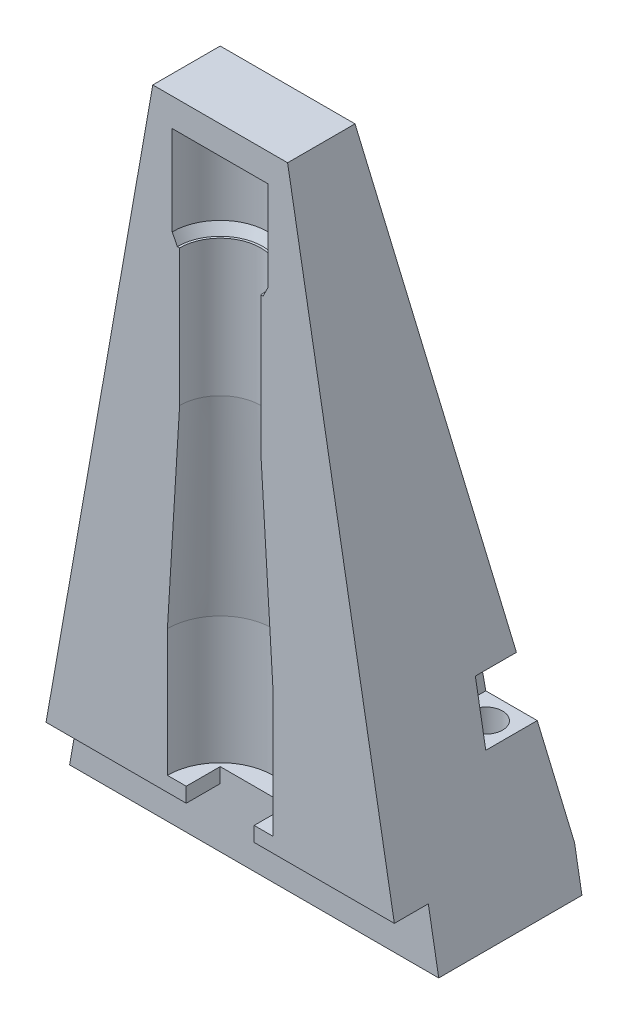
ISO-10303-21;
HEADER;
FILE_DESCRIPTION(('STEP AP214'),'2;1');
FILE_NAME('part.step','',(''),(''),'','','');
FILE_SCHEMA(('AUTOMOTIVE_DESIGN { 1 0 10303 214 1 1 1 1 }'));
ENDSEC;
DATA;
#1=APPLICATION_CONTEXT('core data for automotive mechanical design processes');
#2=APPLICATION_PROTOCOL_DEFINITION('international standard','automotive_design',2000,#1);
#3=PRODUCT_CONTEXT('',#1,'mechanical');
#4=PRODUCT('Part','Part','',(#3));
#5=PRODUCT_RELATED_PRODUCT_CATEGORY('part','',(#4));
#6=PRODUCT_DEFINITION_FORMATION('','',#4);
#7=PRODUCT_DEFINITION_CONTEXT('part definition',#1,'design');
#8=PRODUCT_DEFINITION('design','',#6,#7);
#9=PRODUCT_DEFINITION_SHAPE('','',#8);
#10=(LENGTH_UNIT() NAMED_UNIT(*) SI_UNIT(.MILLI.,.METRE.));
#11=(NAMED_UNIT(*) PLANE_ANGLE_UNIT() SI_UNIT($,.RADIAN.));
#12=(NAMED_UNIT(*) SI_UNIT($,.STERADIAN.) SOLID_ANGLE_UNIT());
#13=UNCERTAINTY_MEASURE_WITH_UNIT(LENGTH_MEASURE(1.E-05),#10,'distance_accuracy_value','');
#14=(GEOMETRIC_REPRESENTATION_CONTEXT(3) GLOBAL_UNCERTAINTY_ASSIGNED_CONTEXT((#13)) GLOBAL_UNIT_ASSIGNED_CONTEXT((#10,
#11,#12)) REPRESENTATION_CONTEXT('',''));
#15=CARTESIAN_POINT('',(0.,0.,0.));
#16=DIRECTION('',(0.,0.,1.));
#17=DIRECTION('',(1.,0.,0.));
#18=AXIS2_PLACEMENT_3D('',#15,#16,#17);
#19=CARTESIAN_POINT('',(-25.,0.,-25.));
#20=DIRECTION('',(0.,0.17364817766693,-0.984807753012208));
#21=DIRECTION('',(0.,0.984807753012208,0.17364817766693));
#22=AXIS2_PLACEMENT_3D('',#19,#20,#21);
#23=PLANE('',#22);
#24=DIRECTION('',(0.171087869746036,-0.970287525247814,-0.171087869746036));
#25=VECTOR('',#24,1.);
#26=CARTESIAN_POINT('',(23.5364470412882,8.30022128679006,-23.5364470412882));
#27=LINE('',#26,#25);
#28=CARTESIAN_POINT('',(21.4734603858307,20.,-21.4734603858307));
#29=VERTEX_POINT('',#28);
#30=CARTESIAN_POINT('',(24.,5.6712818196179,-24.));
#31=VERTEX_POINT('',#30);
#32=EDGE_CURVE('E242',#29,#31,#27,.T.);
#33=ORIENTED_EDGE('',*,*,#32,.T.);
#34=DIRECTION('',(1.,0.,0.));
#35=VECTOR('',#34,1.);
#36=CARTESIAN_POINT('',(-25.,5.67128181961774,-24.));
#37=LINE('',#36,#35);
#38=CARTESIAN_POINT('',(-24.,5.67128181961774,-24.));
#39=VERTEX_POINT('',#38);
#40=EDGE_CURVE('E224',#31,#39,#37,.F.);
#41=ORIENTED_EDGE('',*,*,#40,.T.);
#42=DIRECTION('',(-0.171087869746036,-0.970287525247814,-0.171087869746036));
#43=VECTOR('',#42,1.);
#44=CARTESIAN_POINT('',(-25.,0.,-25.));
#45=LINE('',#44,#43);
#46=CARTESIAN_POINT('',(-21.4734603858307,20.,-21.4734603858307));
#47=VERTEX_POINT('',#46);
#48=EDGE_CURVE('E223',#47,#39,#45,.T.);
#49=ORIENTED_EDGE('',*,*,#48,.F.);
#50=DIRECTION('',(1.,0.,0.));
#51=VECTOR('',#50,1.);
#52=CARTESIAN_POINT('',(-25.,20.,-21.4734603858307));
#53=LINE('',#52,#51);
#54=CARTESIAN_POINT('',(-14.5,20.,-21.4734603858307));
#55=VERTEX_POINT('',#54);
#56=EDGE_CURVE('E354',#55,#47,#53,.F.);
#57=ORIENTED_EDGE('',*,*,#56,.F.);
#58=DIRECTION('',(0.,0.984807753012208,0.17364817766693));
#59=VECTOR('',#58,1.);
#60=CARTESIAN_POINT('',(-14.5,0.,-25.));
#61=LINE('',#60,#59);
#62=CARTESIAN_POINT('',(-14.5,28.,-20.062844540163));
#63=VERTEX_POINT('',#62);
#64=EDGE_CURVE('E293',#63,#55,#61,.F.);
#65=ORIENTED_EDGE('',*,*,#64,.F.);
#66=DIRECTION('',(-1.,0.,0.));
#67=VECTOR('',#66,1.);
#68=CARTESIAN_POINT('',(-25.,28.,-20.062844540163));
#69=LINE('',#68,#67);
#70=CARTESIAN_POINT('',(-20.062844540163,28.,-20.062844540163));
#71=VERTEX_POINT('',#70);
#72=EDGE_CURVE('E352',#71,#63,#69,.F.);
#73=ORIENTED_EDGE('',*,*,#72,.F.);
#74=CARTESIAN_POINT('',(-9.13057173623815,90.,-9.13057173623815));
#75=VERTEX_POINT('',#74);
#76=EDGE_CURVE('E243',#75,#71,#45,.T.);
#77=ORIENTED_EDGE('',*,*,#76,.F.);
#78=DIRECTION('',(1.,0.,0.));
#79=VECTOR('',#78,1.);
#80=CARTESIAN_POINT('',(-25.,90.,-9.13057173623815));
#81=LINE('',#80,#79);
#82=CARTESIAN_POINT('',(9.13057173623814,90.,-9.13057173623815));
#83=VERTEX_POINT('',#82);
#84=EDGE_CURVE('E232',#83,#75,#81,.F.);
#85=ORIENTED_EDGE('',*,*,#84,.F.);
#86=CARTESIAN_POINT('',(20.062844540163,28.,-20.062844540163));
#87=VERTEX_POINT('',#86);
#88=EDGE_CURVE('E238',#83,#87,#27,.T.);
#89=ORIENTED_EDGE('',*,*,#88,.T.);
#90=DIRECTION('',(1.,0.,0.));
#91=VECTOR('',#90,1.);
#92=CARTESIAN_POINT('',(-25.,28.,-20.062844540163));
#93=LINE('',#92,#91);
#94=CARTESIAN_POINT('',(14.5,28.,-20.062844540163));
#95=VERTEX_POINT('',#94);
#96=EDGE_CURVE('E309',#87,#95,#93,.F.);
#97=ORIENTED_EDGE('',*,*,#96,.T.);
#98=DIRECTION('',(0.,0.984807753012208,0.17364817766693));
#99=VECTOR('',#98,1.);
#100=CARTESIAN_POINT('',(14.5,0.,-25.));
#101=LINE('',#100,#99);
#102=CARTESIAN_POINT('',(14.5,20.,-21.4734603858307));
#103=VERTEX_POINT('',#102);
#104=EDGE_CURVE('E45',#95,#103,#101,.F.);
#105=ORIENTED_EDGE('',*,*,#104,.T.);
#106=DIRECTION('',(-1.,0.,0.));
#107=VECTOR('',#106,1.);
#108=CARTESIAN_POINT('',(-25.,20.,-21.4734603858307));
#109=LINE('',#108,#107);
#110=EDGE_CURVE('E307',#103,#29,#109,.F.);
#111=ORIENTED_EDGE('',*,*,#110,.T.);
#112=EDGE_LOOP('',(#33,#41,#49,#57,#65,#73,#77,#85,#89,#97,#105,#111));
#113=FACE_BOUND('',#112,.T.);
#114=ADVANCED_FACE('F37',(#113),#23,.T.);
#115=CARTESIAN_POINT('',(-25.,0.,-25.));
#116=DIRECTION('',(-0.984807753012208,0.17364817766693,0.));
#117=DIRECTION('',(-0.17364817766693,-0.984807753012208,0.));
#118=AXIS2_PLACEMENT_3D('',#115,#116,#117);
#119=PLANE('',#118);
#120=ORIENTED_EDGE('',*,*,#48,.T.);
#121=DIRECTION('',(0.17364817766693,0.984807753012208,0.));
#122=VECTOR('',#121,1.);
#123=CARTESIAN_POINT('',(-25.,0.,-24.));
#124=LINE('',#123,#122);
#125=CARTESIAN_POINT('',(-25.,0.,-24.));
#126=VERTEX_POINT('',#125);
#127=EDGE_CURVE('E209',#39,#126,#124,.F.);
#128=ORIENTED_EDGE('',*,*,#127,.T.);
#129=DIRECTION('',(0.,0.,1.));
#130=VECTOR('',#129,1.);
#131=CARTESIAN_POINT('',(-25.,0.,-25.));
#132=LINE('',#131,#130);
#133=CARTESIAN_POINT('',(-25.,0.,-4.60000000000001));
#134=VERTEX_POINT('',#133);
#135=EDGE_CURVE('E219',#126,#134,#132,.T.);
#136=ORIENTED_EDGE('',*,*,#135,.T.);
#137=DIRECTION('',(-0.17364817766693,-0.984807753012208,0.));
#138=VECTOR('',#137,1.);
#139=CARTESIAN_POINT('',(-25.,0.,-4.60000000000001));
#140=LINE('',#139,#138);
#141=CARTESIAN_POINT('',(-23.5893841543323,8.,-4.60000000000001));
#142=VERTEX_POINT('',#141);
#143=EDGE_CURVE('E381',#134,#142,#140,.F.);
#144=ORIENTED_EDGE('',*,*,#143,.T.);
#145=DIRECTION('',(0.,0.,-1.));
#146=VECTOR('',#145,1.);
#147=CARTESIAN_POINT('',(-23.5893841543323,8.,-25.));
#148=LINE('',#147,#146);
#149=CARTESIAN_POINT('',(-23.5893841543323,8.,0.));
#150=VERTEX_POINT('',#149);
#151=EDGE_CURVE('E375',#142,#150,#148,.F.);
#152=ORIENTED_EDGE('',*,*,#151,.T.);
#153=DIRECTION('',(-0.17364817766693,-0.984807753012208,0.));
#154=VECTOR('',#153,1.);
#155=CARTESIAN_POINT('',(-25.,0.,0.));
#156=LINE('',#155,#154);
#157=CARTESIAN_POINT('',(-9.13057173623815,90.,0.));
#158=VERTEX_POINT('',#157);
#159=EDGE_CURVE('E411',#150,#158,#156,.F.);
#160=ORIENTED_EDGE('',*,*,#159,.T.);
#161=DIRECTION('',(0.,0.,-1.));
#162=VECTOR('',#161,1.);
#163=CARTESIAN_POINT('',(-9.13057173623816,90.,-25.));
#164=LINE('',#163,#162);
#165=EDGE_CURVE('E247',#75,#158,#164,.F.);
#166=ORIENTED_EDGE('',*,*,#165,.F.);
#167=ORIENTED_EDGE('',*,*,#76,.T.);
#168=DIRECTION('',(0.,0.,1.));
#169=VECTOR('',#168,1.);
#170=CARTESIAN_POINT('',(-20.062844540163,28.,-25.));
#171=LINE('',#170,#169);
#172=CARTESIAN_POINT('',(-20.062844540163,28.,-14.5));
#173=VERTEX_POINT('',#172);
#174=EDGE_CURVE('E288',#173,#71,#171,.F.);
#175=ORIENTED_EDGE('',*,*,#174,.F.);
#176=DIRECTION('',(-0.17364817766693,-0.984807753012208,0.));
#177=VECTOR('',#176,1.);
#178=CARTESIAN_POINT('',(-25.,0.,-14.5));
#179=LINE('',#178,#177);
#180=CARTESIAN_POINT('',(-21.4734603858307,20.,-14.5));
#181=VERTEX_POINT('',#180);
#182=EDGE_CURVE('E286',#181,#173,#179,.F.);
#183=ORIENTED_EDGE('',*,*,#182,.F.);
#184=DIRECTION('',(0.,0.,-1.));
#185=VECTOR('',#184,1.);
#186=CARTESIAN_POINT('',(-21.4734603858307,20.,-25.));
#187=LINE('',#186,#185);
#188=EDGE_CURVE('E290',#47,#181,#187,.F.);
#189=ORIENTED_EDGE('',*,*,#188,.F.);
#190=EDGE_LOOP('',(#120,#128,#136,#144,#152,#160,#166,#167,#175,#183,#189));
#191=FACE_BOUND('',#190,.T.);
#192=ADVANCED_FACE('F217',(#191),#119,.T.);
#193=CARTESIAN_POINT('',(0.,0.,0.));
#194=DIRECTION('',(0.,0.,-1.));
#195=DIRECTION('',(-1.,0.,0.));
#196=AXIS2_PLACEMENT_3D('',#193,#194,#195);
#197=PLANE('',#196);
#198=ORIENTED_EDGE('',*,*,#159,.F.);
#199=DIRECTION('',(-1.,0.,0.));
#200=VECTOR('',#199,1.);
#201=CARTESIAN_POINT('',(25.,8.,0.));
#202=LINE('',#201,#200);
#203=CARTESIAN_POINT('',(-4.6,8.,0.));
#204=VERTEX_POINT('',#203);
#205=EDGE_CURVE('E368',#204,#150,#202,.T.);
#206=ORIENTED_EDGE('',*,*,#205,.F.);
#207=DIRECTION('',(0.,1.,0.));
#208=VECTOR('',#207,1.);
#209=CARTESIAN_POINT('',(-4.6,30.2638391437749,0.));
#210=LINE('',#209,#208);
#211=CARTESIAN_POINT('',(-4.6,10.,0.));
#212=VERTEX_POINT('',#211);
#213=EDGE_CURVE('E388',#212,#204,#210,.F.);
#214=ORIENTED_EDGE('',*,*,#213,.F.);
#215=DIRECTION('',(-1.,0.,0.));
#216=VECTOR('',#215,1.);
#217=CARTESIAN_POINT('',(0.,10.,0.));
#218=LINE('',#217,#216);
#219=CARTESIAN_POINT('',(-7.15,9.99999999999999,0.));
#220=VERTEX_POINT('',#219);
#221=EDGE_CURVE('E241',#212,#220,#218,.T.);
#222=ORIENTED_EDGE('',*,*,#221,.T.);
#223=DIRECTION('',(0.,1.,0.));
#224=VECTOR('',#223,1.);
#225=CARTESIAN_POINT('',(-7.15,88.0937098717509,0.));
#226=LINE('',#225,#224);
#227=CARTESIAN_POINT('',(-7.15,27.2152635403747,0.));
#228=VERTEX_POINT('',#227);
#229=EDGE_CURVE('E269',#228,#220,#226,.F.);
#230=ORIENTED_EDGE('',*,*,#229,.F.);
#231=DIRECTION('',(0.0609973179413581,0.998137929949544,0.));
#232=VECTOR('',#231,1.);
#233=CARTESIAN_POINT('',(0.,144.21526354038,0.));
#234=LINE('',#233,#232);
#235=CARTESIAN_POINT('',(-5.5,54.215263540376,0.));
#236=VERTEX_POINT('',#235);
#237=EDGE_CURVE('E272',#236,#228,#234,.F.);
#238=ORIENTED_EDGE('',*,*,#237,.F.);
#239=DIRECTION('',(0.,1.,0.));
#240=VECTOR('',#239,1.);
#241=CARTESIAN_POINT('',(-5.5,88.0937098717509,0.));
#242=LINE('',#241,#240);
#243=CARTESIAN_POINT('',(-5.5,72.7,0.));
#244=VERTEX_POINT('',#243);
#245=EDGE_CURVE('E274',#244,#236,#242,.F.);
#246=ORIENTED_EDGE('',*,*,#245,.F.);
#247=DIRECTION('',(1.,0.,0.));
#248=VECTOR('',#247,1.);
#249=CARTESIAN_POINT('',(0.,72.7,0.));
#250=LINE('',#249,#248);
#251=CARTESIAN_POINT('',(-5.80901699437495,72.7,0.));
#252=VERTEX_POINT('',#251);
#253=EDGE_CURVE('E264',#252,#244,#250,.T.);
#254=ORIENTED_EDGE('',*,*,#253,.F.);
#255=DIRECTION('',(-0.447213595499959,0.894427190999915,0.));
#256=VECTOR('',#255,1.);
#257=CARTESIAN_POINT('',(0.,61.0819660112501,0.));
#258=LINE('',#257,#256);
#259=CARTESIAN_POINT('',(-6.49999999999999,74.0819660112501,0.));
#260=VERTEX_POINT('',#259);
#261=EDGE_CURVE('E276',#260,#252,#258,.F.);
#262=ORIENTED_EDGE('',*,*,#261,.F.);
#263=DIRECTION('',(0.,1.,0.));
#264=VECTOR('',#263,1.);
#265=CARTESIAN_POINT('',(-6.5,88.0937098717509,0.));
#266=LINE('',#265,#264);
#267=CARTESIAN_POINT('',(-6.5,86.2,0.));
#268=VERTEX_POINT('',#267);
#269=EDGE_CURVE('E278',#268,#260,#266,.F.);
#270=ORIENTED_EDGE('',*,*,#269,.F.);
#271=DIRECTION('',(1.,0.,0.));
#272=VECTOR('',#271,1.);
#273=CARTESIAN_POINT('',(0.,86.2,0.));
#274=LINE('',#273,#272);
#275=CARTESIAN_POINT('',(6.5,86.2,0.));
#276=VERTEX_POINT('',#275);
#277=EDGE_CURVE('E253',#268,#276,#274,.T.);
#278=ORIENTED_EDGE('',*,*,#277,.T.);
#279=DIRECTION('',(0.,1.,0.));
#280=VECTOR('',#279,1.);
#281=CARTESIAN_POINT('',(6.5,88.0937098717509,0.));
#282=LINE('',#281,#280);
#283=CARTESIAN_POINT('',(6.49999999999999,74.0819660112501,0.));
#284=VERTEX_POINT('',#283);
#285=EDGE_CURVE('E266',#284,#276,#282,.T.);
#286=ORIENTED_EDGE('',*,*,#285,.F.);
#287=DIRECTION('',(-0.447213595499959,-0.894427190999915,0.));
#288=VECTOR('',#287,1.);
#289=CARTESIAN_POINT('',(0.,61.0819660112501,0.));
#290=LINE('',#289,#288);
#291=CARTESIAN_POINT('',(5.80901699437495,72.7,0.));
#292=VERTEX_POINT('',#291);
#293=EDGE_CURVE('E263',#292,#284,#290,.F.);
#294=ORIENTED_EDGE('',*,*,#293,.F.);
#295=CARTESIAN_POINT('',(5.5,72.7,0.));
#296=VERTEX_POINT('',#295);
#297=EDGE_CURVE('E261',#296,#292,#250,.T.);
#298=ORIENTED_EDGE('',*,*,#297,.F.);
#299=DIRECTION('',(0.,1.,0.));
#300=VECTOR('',#299,1.);
#301=CARTESIAN_POINT('',(5.5,88.0937098717509,0.));
#302=LINE('',#301,#300);
#303=CARTESIAN_POINT('',(5.5,54.215263540376,0.));
#304=VERTEX_POINT('',#303);
#305=EDGE_CURVE('E259',#304,#296,#302,.T.);
#306=ORIENTED_EDGE('',*,*,#305,.F.);
#307=DIRECTION('',(0.0609973179413581,-0.998137929949544,0.));
#308=VECTOR('',#307,1.);
#309=CARTESIAN_POINT('',(0.,144.21526354038,0.));
#310=LINE('',#309,#308);
#311=CARTESIAN_POINT('',(7.15,27.2152635403747,0.));
#312=VERTEX_POINT('',#311);
#313=EDGE_CURVE('E257',#312,#304,#310,.F.);
#314=ORIENTED_EDGE('',*,*,#313,.F.);
#315=DIRECTION('',(0.,1.,0.));
#316=VECTOR('',#315,1.);
#317=CARTESIAN_POINT('',(7.15,88.0937098717509,0.));
#318=LINE('',#317,#316);
#319=CARTESIAN_POINT('',(7.15,9.99999999999999,0.));
#320=VERTEX_POINT('',#319);
#321=EDGE_CURVE('E255',#320,#312,#318,.T.);
#322=ORIENTED_EDGE('',*,*,#321,.F.);
#323=CARTESIAN_POINT('',(4.6,10.,0.));
#324=VERTEX_POINT('',#323);
#325=EDGE_CURVE('E250',#320,#324,#218,.T.);
#326=ORIENTED_EDGE('',*,*,#325,.T.);
#327=DIRECTION('',(0.,1.,0.));
#328=VECTOR('',#327,1.);
#329=CARTESIAN_POINT('',(4.6,30.2638391437749,0.));
#330=LINE('',#329,#328);
#331=CARTESIAN_POINT('',(4.6,8.,0.));
#332=VERTEX_POINT('',#331);
#333=EDGE_CURVE('E386',#332,#324,#330,.T.);
#334=ORIENTED_EDGE('',*,*,#333,.F.);
#335=CARTESIAN_POINT('',(23.5893841543323,8.,0.));
#336=VERTEX_POINT('',#335);
#337=EDGE_CURVE('E370',#336,#332,#202,.T.);
#338=ORIENTED_EDGE('',*,*,#337,.F.);
#339=DIRECTION('',(-0.17364817766693,0.984807753012208,0.));
#340=VECTOR('',#339,1.);
#341=CARTESIAN_POINT('',(25.,0.,0.));
#342=LINE('',#341,#340);
#343=CARTESIAN_POINT('',(9.13057173623815,90.,0.));
#344=VERTEX_POINT('',#343);
#345=EDGE_CURVE('E413',#344,#336,#342,.F.);
#346=ORIENTED_EDGE('',*,*,#345,.F.);
#347=DIRECTION('',(-1.,0.,0.));
#348=VECTOR('',#347,1.);
#349=CARTESIAN_POINT('',(0.,90.,0.));
#350=LINE('',#349,#348);
#351=EDGE_CURVE('E234',#344,#158,#350,.T.);
#352=ORIENTED_EDGE('',*,*,#351,.T.);
#353=EDGE_LOOP('',(#198,#206,#214,#222,#230,#238,#246,#254,#262,#270,#278,#286,#294,#298,#306,
#314,#322,#326,#334,#338,#346,#352));
#354=FACE_BOUND('',#353,.T.);
#355=ADVANCED_FACE('F419',(#354),#197,.F.);
#356=CARTESIAN_POINT('',(-6.4,10.,0.));
#357=DIRECTION('',(0.,-1.,0.));
#358=DIRECTION('',(0.,0.,1.));
#359=AXIS2_PLACEMENT_3D('',#356,#357,#358);
#360=PLANE('',#359);
#361=DIRECTION('',(-1.,0.,0.));
#362=VECTOR('',#361,1.);
#363=CARTESIAN_POINT('',(-4.6,10.,-4.6));
#364=LINE('',#363,#362);
#365=CARTESIAN_POINT('',(4.6,10.,-4.6));
#366=VERTEX_POINT('',#365);
#367=CARTESIAN_POINT('',(-4.6,10.,-4.6));
#368=VERTEX_POINT('',#367);
#369=EDGE_CURVE('E361',#366,#368,#364,.T.);
#370=ORIENTED_EDGE('',*,*,#369,.F.);
#371=DIRECTION('',(0.,0.,1.));
#372=VECTOR('',#371,1.);
#373=CARTESIAN_POINT('',(4.6,10.,-17.6107647738325));
#374=LINE('',#373,#372);
#375=EDGE_CURVE('E363',#366,#324,#374,.T.);
#376=ORIENTED_EDGE('',*,*,#375,.T.);
#377=ORIENTED_EDGE('',*,*,#325,.F.);
#378=CARTESIAN_POINT('',(0.,9.99999999999999,0.));
#379=DIRECTION('',(0.,1.,0.));
#380=DIRECTION('',(0.,0.,1.));
#381=AXIS2_PLACEMENT_3D('',#378,#379,#380);
#382=CIRCLE('',#381,7.15);
#383=EDGE_CURVE('E390',#320,#220,#382,.T.);
#384=ORIENTED_EDGE('',*,*,#383,.T.);
#385=ORIENTED_EDGE('',*,*,#221,.F.);
#386=DIRECTION('',(0.,0.,1.));
#387=VECTOR('',#386,1.);
#388=CARTESIAN_POINT('',(-4.6,10.,-17.6107647738325));
#389=LINE('',#388,#387);
#390=EDGE_CURVE('E360',#368,#212,#389,.T.);
#391=ORIENTED_EDGE('',*,*,#390,.F.);
#392=EDGE_LOOP('',(#370,#376,#377,#384,#385,#391));
#393=FACE_BOUND('',#392,.T.);
#394=ADVANCED_FACE('F443',(#393),#360,.F.);
#395=CARTESIAN_POINT('',(0.,86.2,0.));
#396=DIRECTION('',(0.,1.,0.));
#397=DIRECTION('',(-1.,0.,0.));
#398=AXIS2_PLACEMENT_3D('',#395,#396,#397);
#399=PLANE('',#398);
#400=ORIENTED_EDGE('',*,*,#277,.F.);
#401=CARTESIAN_POINT('',(0.,86.2,0.));
#402=DIRECTION('',(0.,1.,0.));
#403=DIRECTION('',(0.,0.,1.));
#404=AXIS2_PLACEMENT_3D('',#401,#402,#403);
#405=CIRCLE('',#404,6.5);
#406=EDGE_CURVE('E408',#276,#268,#405,.T.);
#407=ORIENTED_EDGE('',*,*,#406,.F.);
#408=EDGE_LOOP('',(#400,#407));
#409=FACE_BOUND('',#408,.T.);
#410=ADVANCED_FACE('F39',(#409),#399,.F.);
#411=CARTESIAN_POINT('',(25.,0.,-25.));
#412=DIRECTION('',(0.984807753012208,0.17364817766693,0.));
#413=DIRECTION('',(-0.17364817766693,0.984807753012208,0.));
#414=AXIS2_PLACEMENT_3D('',#411,#412,#413);
#415=PLANE('',#414);
#416=DIRECTION('',(0.,0.,-1.));
#417=VECTOR('',#416,1.);
#418=CARTESIAN_POINT('',(25.,0.,-25.));
#419=LINE('',#418,#417);
#420=CARTESIAN_POINT('',(25.,0.,-4.6));
#421=VERTEX_POINT('',#420);
#422=CARTESIAN_POINT('',(25.,0.,-24.));
#423=VERTEX_POINT('',#422);
#424=EDGE_CURVE('E230',#421,#423,#419,.T.);
#425=ORIENTED_EDGE('',*,*,#424,.T.);
#426=DIRECTION('',(0.17364817766693,-0.984807753012208,0.));
#427=VECTOR('',#426,1.);
#428=CARTESIAN_POINT('',(25.,0.,-24.));
#429=LINE('',#428,#427);
#430=EDGE_CURVE('E52',#423,#31,#429,.F.);
#431=ORIENTED_EDGE('',*,*,#430,.T.);
#432=ORIENTED_EDGE('',*,*,#32,.F.);
#433=DIRECTION('',(0.,0.,-1.));
#434=VECTOR('',#433,1.);
#435=CARTESIAN_POINT('',(21.4734603858307,20.,-25.));
#436=LINE('',#435,#434);
#437=CARTESIAN_POINT('',(21.4734603858307,20.,-14.5));
#438=VERTEX_POINT('',#437);
#439=EDGE_CURVE('E297',#29,#438,#436,.F.);
#440=ORIENTED_EDGE('',*,*,#439,.T.);
#441=DIRECTION('',(-0.17364817766693,0.984807753012208,0.));
#442=VECTOR('',#441,1.);
#443=CARTESIAN_POINT('',(25.,0.,-14.5));
#444=LINE('',#443,#442);
#445=CARTESIAN_POINT('',(20.062844540163,28.,-14.5));
#446=VERTEX_POINT('',#445);
#447=EDGE_CURVE('E295',#446,#438,#444,.F.);
#448=ORIENTED_EDGE('',*,*,#447,.F.);
#449=DIRECTION('',(0.,0.,1.));
#450=VECTOR('',#449,1.);
#451=CARTESIAN_POINT('',(20.062844540163,28.,-25.));
#452=LINE('',#451,#450);
#453=EDGE_CURVE('E300',#446,#87,#452,.F.);
#454=ORIENTED_EDGE('',*,*,#453,.T.);
#455=ORIENTED_EDGE('',*,*,#88,.F.);
#456=DIRECTION('',(0.,0.,1.));
#457=VECTOR('',#456,1.);
#458=CARTESIAN_POINT('',(9.13057173623814,90.,-25.));
#459=LINE('',#458,#457);
#460=EDGE_CURVE('E229',#344,#83,#459,.F.);
#461=ORIENTED_EDGE('',*,*,#460,.F.);
#462=ORIENTED_EDGE('',*,*,#345,.T.);
#463=DIRECTION('',(0.,0.,1.));
#464=VECTOR('',#463,1.);
#465=CARTESIAN_POINT('',(23.5893841543323,8.,-25.));
#466=LINE('',#465,#464);
#467=CARTESIAN_POINT('',(23.5893841543323,8.,-4.6));
#468=VERTEX_POINT('',#467);
#469=EDGE_CURVE('E378',#336,#468,#466,.F.);
#470=ORIENTED_EDGE('',*,*,#469,.T.);
#471=DIRECTION('',(-0.17364817766693,0.984807753012208,0.));
#472=VECTOR('',#471,1.);
#473=CARTESIAN_POINT('',(25.,0.,-4.6));
#474=LINE('',#473,#472);
#475=EDGE_CURVE('E383',#468,#421,#474,.F.);
#476=ORIENTED_EDGE('',*,*,#475,.T.);
#477=EDGE_LOOP('',(#425,#431,#432,#440,#448,#454,#455,#461,#462,#470,#476));
#478=FACE_BOUND('',#477,.T.);
#479=ADVANCED_FACE('F477',(#478),#415,.T.);
#480=CARTESIAN_POINT('',(0.,0.,0.));
#481=DIRECTION('',(0.,1.,0.));
#482=DIRECTION('',(0.,0.,1.));
#483=AXIS2_PLACEMENT_3D('',#480,#481,#482);
#484=PLANE('',#483);
#485=CARTESIAN_POINT('',(-18.,0.,-18.));
#486=DIRECTION('',(0.,-1.,0.));
#487=DIRECTION('',(0.,0.,-1.));
#488=AXIS2_PLACEMENT_3D('',#485,#486,#487);
#489=CIRCLE('',#488,2.25);
#490=CARTESIAN_POINT('',(-18.,0.,-20.25));
#491=VERTEX_POINT('',#490);
#492=EDGE_CURVE('E333',#491,#491,#489,.T.);
#493=ORIENTED_EDGE('',*,*,#492,.F.);
#494=EDGE_LOOP('',(#493));
#495=FACE_BOUND('',#494,.T.);
#496=CARTESIAN_POINT('',(18.,0.,-18.));
#497=DIRECTION('',(0.,-1.,0.));
#498=DIRECTION('',(0.,0.,1.));
#499=AXIS2_PLACEMENT_3D('',#496,#497,#498);
#500=CIRCLE('',#499,2.25);
#501=CARTESIAN_POINT('',(18.,0.,-15.75));
#502=VERTEX_POINT('',#501);
#503=EDGE_CURVE('E328',#502,#502,#500,.T.);
#504=ORIENTED_EDGE('',*,*,#503,.F.);
#505=EDGE_LOOP('',(#504));
#506=FACE_BOUND('',#505,.T.);
#507=ORIENTED_EDGE('',*,*,#135,.F.);
#508=DIRECTION('',(1.,0.,0.));
#509=VECTOR('',#508,1.);
#510=CARTESIAN_POINT('',(0.,0.,-24.));
#511=LINE('',#510,#509);
#512=EDGE_CURVE('E11',#126,#423,#511,.T.);
#513=ORIENTED_EDGE('',*,*,#512,.T.);
#514=ORIENTED_EDGE('',*,*,#424,.F.);
#515=DIRECTION('',(1.,0.,0.));
#516=VECTOR('',#515,1.);
#517=CARTESIAN_POINT('',(25.,0.,-4.6));
#518=LINE('',#517,#516);
#519=EDGE_CURVE('E227',#134,#421,#518,.T.);
#520=ORIENTED_EDGE('',*,*,#519,.F.);
#521=EDGE_LOOP('',(#507,#513,#514,#520));
#522=FACE_BOUND('',#521,.T.);
#523=ADVANCED_FACE('F226',(#495,#506,#522),#484,.F.);
#524=CARTESIAN_POINT('',(0.,90.,0.));
#525=DIRECTION('',(0.,1.,0.));
#526=DIRECTION('',(0.,0.,1.));
#527=AXIS2_PLACEMENT_3D('',#524,#525,#526);
#528=PLANE('',#527);
#529=ORIENTED_EDGE('',*,*,#351,.F.);
#530=ORIENTED_EDGE('',*,*,#460,.T.);
#531=ORIENTED_EDGE('',*,*,#84,.T.);
#532=ORIENTED_EDGE('',*,*,#165,.T.);
#533=EDGE_LOOP('',(#529,#530,#531,#532));
#534=FACE_BOUND('',#533,.T.);
#535=ADVANCED_FACE('F425',(#534),#528,.T.);
#536=CARTESIAN_POINT('',(0.,88.0937098717509,0.));
#537=DIRECTION('',(0.,1.,0.));
#538=DIRECTION('',(0.,0.,1.));
#539=AXIS2_PLACEMENT_3D('',#536,#537,#538);
#540=CYLINDRICAL_SURFACE('',#539,6.5);
#541=ORIENTED_EDGE('',*,*,#269,.T.);
#542=CARTESIAN_POINT('',(0.,74.0819660112501,0.));
#543=DIRECTION('',(0.,1.,0.));
#544=DIRECTION('',(0.,0.,1.));
#545=AXIS2_PLACEMENT_3D('',#542,#543,#544);
#546=CIRCLE('',#545,6.5);
#547=EDGE_CURVE('E405',#284,#260,#546,.T.);
#548=ORIENTED_EDGE('',*,*,#547,.F.);
#549=ORIENTED_EDGE('',*,*,#285,.T.);
#550=ORIENTED_EDGE('',*,*,#406,.T.);
#551=EDGE_LOOP('',(#541,#548,#549,#550));
#552=FACE_BOUND('',#551,.T.);
#553=ADVANCED_FACE('F473',(#552),#540,.F.);
#554=CARTESIAN_POINT('',(0.,72.7,0.));
#555=DIRECTION('',(0.,1.,0.));
#556=DIRECTION('',(0.,0.,1.));
#557=AXIS2_PLACEMENT_3D('',#554,#555,#556);
#558=CONICAL_SURFACE('',#557,5.80901699437495,0.463647609000807);
#559=ORIENTED_EDGE('',*,*,#261,.T.);
#560=CARTESIAN_POINT('',(0.,72.7,0.));
#561=DIRECTION('',(0.,1.,0.));
#562=DIRECTION('',(0.,0.,1.));
#563=AXIS2_PLACEMENT_3D('',#560,#561,#562);
#564=CIRCLE('',#563,5.80901699437495);
#565=EDGE_CURVE('E402',#292,#252,#564,.T.);
#566=ORIENTED_EDGE('',*,*,#565,.F.);
#567=ORIENTED_EDGE('',*,*,#293,.T.);
#568=ORIENTED_EDGE('',*,*,#547,.T.);
#569=EDGE_LOOP('',(#559,#566,#567,#568));
#570=FACE_BOUND('',#569,.T.);
#571=ADVANCED_FACE('F469',(#570),#558,.F.);
#572=CARTESIAN_POINT('',(5.80901699437495,72.7,0.));
#573=DIRECTION('',(0.,1.,0.));
#574=DIRECTION('',(0.,0.,1.));
#575=AXIS2_PLACEMENT_3D('',#572,#573,#574);
#576=PLANE('',#575);
#577=ORIENTED_EDGE('',*,*,#253,.T.);
#578=CARTESIAN_POINT('',(0.,72.7,0.));
#579=DIRECTION('',(0.,1.,0.));
#580=DIRECTION('',(0.,0.,1.));
#581=AXIS2_PLACEMENT_3D('',#578,#579,#580);
#582=CIRCLE('',#581,5.5);
#583=EDGE_CURVE('E399',#296,#244,#582,.T.);
#584=ORIENTED_EDGE('',*,*,#583,.F.);
#585=ORIENTED_EDGE('',*,*,#297,.T.);
#586=ORIENTED_EDGE('',*,*,#565,.T.);
#587=EDGE_LOOP('',(#577,#584,#585,#586));
#588=FACE_BOUND('',#587,.T.);
#589=ADVANCED_FACE('F463',(#588),#576,.T.);
#590=CARTESIAN_POINT('',(0.,88.0937098717509,0.));
#591=DIRECTION('',(0.,1.,0.));
#592=DIRECTION('',(0.,0.,1.));
#593=AXIS2_PLACEMENT_3D('',#590,#591,#592);
#594=CYLINDRICAL_SURFACE('',#593,5.5);
#595=ORIENTED_EDGE('',*,*,#245,.T.);
#596=CARTESIAN_POINT('',(0.,54.215263540376,0.));
#597=DIRECTION('',(0.,1.,0.));
#598=DIRECTION('',(0.,0.,1.));
#599=AXIS2_PLACEMENT_3D('',#596,#597,#598);
#600=CIRCLE('',#599,5.5);
#601=EDGE_CURVE('E396',#304,#236,#600,.T.);
#602=ORIENTED_EDGE('',*,*,#601,.F.);
#603=ORIENTED_EDGE('',*,*,#305,.T.);
#604=ORIENTED_EDGE('',*,*,#583,.T.);
#605=EDGE_LOOP('',(#595,#602,#603,#604));
#606=FACE_BOUND('',#605,.T.);
#607=ADVANCED_FACE('F460',(#606),#594,.F.);
#608=CARTESIAN_POINT('',(0.,27.2152635403747,0.));
#609=DIRECTION('',(0.,-1.,0.));
#610=DIRECTION('',(0.,0.,-1.));
#611=AXIS2_PLACEMENT_3D('',#608,#609,#610);
#612=CONICAL_SURFACE('',#611,7.15,0.061035206589686);
#613=ORIENTED_EDGE('',*,*,#313,.T.);
#614=ORIENTED_EDGE('',*,*,#601,.T.);
#615=ORIENTED_EDGE('',*,*,#237,.T.);
#616=CARTESIAN_POINT('',(0.,27.2152635403747,0.));
#617=DIRECTION('',(0.,1.,0.));
#618=DIRECTION('',(0.,0.,1.));
#619=AXIS2_PLACEMENT_3D('',#616,#617,#618);
#620=CIRCLE('',#619,7.15);
#621=EDGE_CURVE('E393',#312,#228,#620,.T.);
#622=ORIENTED_EDGE('',*,*,#621,.F.);
#623=EDGE_LOOP('',(#613,#614,#615,#622));
#624=FACE_BOUND('',#623,.T.);
#625=ADVANCED_FACE('F453',(#624),#612,.F.);
#626=CARTESIAN_POINT('',(0.,88.0937098717509,0.));
#627=DIRECTION('',(0.,1.,0.));
#628=DIRECTION('',(0.,0.,1.));
#629=AXIS2_PLACEMENT_3D('',#626,#627,#628);
#630=CYLINDRICAL_SURFACE('',#629,7.15);
#631=ORIENTED_EDGE('',*,*,#229,.T.);
#632=ORIENTED_EDGE('',*,*,#383,.F.);
#633=ORIENTED_EDGE('',*,*,#321,.T.);
#634=ORIENTED_EDGE('',*,*,#621,.T.);
#635=EDGE_LOOP('',(#631,#632,#633,#634));
#636=FACE_BOUND('',#635,.T.);
#637=ADVANCED_FACE('F448',(#636),#630,.F.);
#638=CARTESIAN_POINT('',(25.,8.,-4.6));
#639=DIRECTION('',(0.,0.,-1.));
#640=DIRECTION('',(-1.,0.,0.));
#641=AXIS2_PLACEMENT_3D('',#638,#639,#640);
#642=PLANE('',#641);
#643=ORIENTED_EDGE('',*,*,#369,.T.);
#644=DIRECTION('',(0.,-1.,0.));
#645=VECTOR('',#644,1.);
#646=CARTESIAN_POINT('',(-4.6,10.,-4.6));
#647=LINE('',#646,#645);
#648=CARTESIAN_POINT('',(-4.6,8.,-4.6));
#649=VERTEX_POINT('',#648);
#650=EDGE_CURVE('E357',#368,#649,#647,.T.);
#651=ORIENTED_EDGE('',*,*,#650,.T.);
#652=DIRECTION('',(1.,0.,0.));
#653=VECTOR('',#652,1.);
#654=CARTESIAN_POINT('',(25.,8.,-4.6));
#655=LINE('',#654,#653);
#656=EDGE_CURVE('E373',#142,#649,#655,.T.);
#657=ORIENTED_EDGE('',*,*,#656,.F.);
#658=ORIENTED_EDGE('',*,*,#143,.F.);
#659=ORIENTED_EDGE('',*,*,#519,.T.);
#660=ORIENTED_EDGE('',*,*,#475,.F.);
#661=CARTESIAN_POINT('',(4.6,8.,-4.6));
#662=VERTEX_POINT('',#661);
#663=EDGE_CURVE('E371',#662,#468,#655,.T.);
#664=ORIENTED_EDGE('',*,*,#663,.F.);
#665=DIRECTION('',(0.,1.,0.));
#666=VECTOR('',#665,1.);
#667=CARTESIAN_POINT('',(4.6,10.,-4.6));
#668=LINE('',#667,#666);
#669=EDGE_CURVE('E356',#662,#366,#668,.T.);
#670=ORIENTED_EDGE('',*,*,#669,.T.);
#671=EDGE_LOOP('',(#643,#651,#657,#658,#659,#660,#664,#670));
#672=FACE_BOUND('',#671,.T.);
#673=ADVANCED_FACE('F434',(#672),#642,.F.);
#674=CARTESIAN_POINT('',(0.,8.,0.));
#675=DIRECTION('',(0.,1.,0.));
#676=DIRECTION('',(0.,0.,1.));
#677=AXIS2_PLACEMENT_3D('',#674,#675,#676);
#678=PLANE('',#677);
#679=ORIENTED_EDGE('',*,*,#337,.T.);
#680=DIRECTION('',(0.,0.,-1.));
#681=VECTOR('',#680,1.);
#682=CARTESIAN_POINT('',(4.6,8.,0.));
#683=LINE('',#682,#681);
#684=EDGE_CURVE('E283',#332,#662,#683,.T.);
#685=ORIENTED_EDGE('',*,*,#684,.T.);
#686=ORIENTED_EDGE('',*,*,#663,.T.);
#687=ORIENTED_EDGE('',*,*,#469,.F.);
#688=EDGE_LOOP('',(#679,#685,#686,#687));
#689=FACE_BOUND('',#688,.T.);
#690=ADVANCED_FACE('F512',(#689),#678,.F.);
#691=ORIENTED_EDGE('',*,*,#656,.T.);
#692=DIRECTION('',(0.,0.,1.));
#693=VECTOR('',#692,1.);
#694=CARTESIAN_POINT('',(-4.6,8.,0.));
#695=LINE('',#694,#693);
#696=EDGE_CURVE('E280',#649,#204,#695,.T.);
#697=ORIENTED_EDGE('',*,*,#696,.T.);
#698=ORIENTED_EDGE('',*,*,#205,.T.);
#699=ORIENTED_EDGE('',*,*,#151,.F.);
#700=EDGE_LOOP('',(#691,#697,#698,#699));
#701=FACE_BOUND('',#700,.T.);
#702=ADVANCED_FACE('F432',(#701),#678,.F.);
#703=CARTESIAN_POINT('',(4.6,10.,-17.6107647738325));
#704=DIRECTION('',(1.,0.,0.));
#705=DIRECTION('',(0.,1.,0.));
#706=AXIS2_PLACEMENT_3D('',#703,#704,#705);
#707=PLANE('',#706);
#708=ORIENTED_EDGE('',*,*,#333,.T.);
#709=ORIENTED_EDGE('',*,*,#375,.F.);
#710=ORIENTED_EDGE('',*,*,#669,.F.);
#711=ORIENTED_EDGE('',*,*,#684,.F.);
#712=EDGE_LOOP('',(#708,#709,#710,#711));
#713=FACE_BOUND('',#712,.T.);
#714=ADVANCED_FACE('F516',(#713),#707,.F.);
#715=CARTESIAN_POINT('',(-4.6,10.,-17.6107647738325));
#716=DIRECTION('',(-1.,0.,0.));
#717=DIRECTION('',(0.,-1.,0.));
#718=AXIS2_PLACEMENT_3D('',#715,#716,#717);
#719=PLANE('',#718);
#720=ORIENTED_EDGE('',*,*,#650,.F.);
#721=ORIENTED_EDGE('',*,*,#390,.T.);
#722=ORIENTED_EDGE('',*,*,#213,.T.);
#723=ORIENTED_EDGE('',*,*,#696,.F.);
#724=EDGE_LOOP('',(#720,#721,#722,#723));
#725=FACE_BOUND('',#724,.T.);
#726=ADVANCED_FACE('F439',(#725),#719,.F.);
#727=CARTESIAN_POINT('',(-14.5,28.,-14.5));
#728=DIRECTION('',(-1.,0.,0.));
#729=DIRECTION('',(0.,-1.,0.));
#730=AXIS2_PLACEMENT_3D('',#727,#728,#729);
#731=PLANE('',#730);
#732=ORIENTED_EDGE('',*,*,#64,.T.);
#733=DIRECTION('',(0.,0.,-1.));
#734=VECTOR('',#733,1.);
#735=CARTESIAN_POINT('',(-14.5,20.,-14.5));
#736=LINE('',#735,#734);
#737=CARTESIAN_POINT('',(-14.5,20.,-14.5));
#738=VERTEX_POINT('',#737);
#739=EDGE_CURVE('E349',#738,#55,#736,.T.);
#740=ORIENTED_EDGE('',*,*,#739,.F.);
#741=DIRECTION('',(0.,1.,0.));
#742=VECTOR('',#741,1.);
#743=CARTESIAN_POINT('',(-14.5,28.,-14.5));
#744=LINE('',#743,#742);
#745=CARTESIAN_POINT('',(-14.5,28.,-14.5));
#746=VERTEX_POINT('',#745);
#747=EDGE_CURVE('E341',#738,#746,#744,.T.);
#748=ORIENTED_EDGE('',*,*,#747,.T.);
#749=DIRECTION('',(0.,0.,-1.));
#750=VECTOR('',#749,1.);
#751=CARTESIAN_POINT('',(-14.5,28.,-14.5));
#752=LINE('',#751,#750);
#753=EDGE_CURVE('E346',#746,#63,#752,.T.);
#754=ORIENTED_EDGE('',*,*,#753,.T.);
#755=EDGE_LOOP('',(#732,#740,#748,#754));
#756=FACE_BOUND('',#755,.T.);
#757=ADVANCED_FACE('F522',(#756),#731,.T.);
#758=CARTESIAN_POINT('',(-14.5,20.,-14.5));
#759=DIRECTION('',(0.,1.,0.));
#760=DIRECTION('',(0.,0.,1.));
#761=AXIS2_PLACEMENT_3D('',#758,#759,#760);
#762=PLANE('',#761);
#763=CARTESIAN_POINT('',(-18.,20.,-18.));
#764=DIRECTION('',(0.,-1.,0.));
#765=DIRECTION('',(0.,0.,-1.));
#766=AXIS2_PLACEMENT_3D('',#763,#764,#765);
#767=CIRCLE('',#766,2.25);
#768=CARTESIAN_POINT('',(-18.,20.,-20.25));
#769=VERTEX_POINT('',#768);
#770=EDGE_CURVE('E329',#769,#769,#767,.T.);
#771=ORIENTED_EDGE('',*,*,#770,.T.);
#772=EDGE_LOOP('',(#771));
#773=FACE_BOUND('',#772,.T.);
#774=ORIENTED_EDGE('',*,*,#56,.T.);
#775=ORIENTED_EDGE('',*,*,#188,.T.);
#776=DIRECTION('',(1.,0.,0.));
#777=VECTOR('',#776,1.);
#778=CARTESIAN_POINT('',(-14.5,20.,-14.5));
#779=LINE('',#778,#777);
#780=EDGE_CURVE('E332',#181,#738,#779,.T.);
#781=ORIENTED_EDGE('',*,*,#780,.T.);
#782=ORIENTED_EDGE('',*,*,#739,.T.);
#783=EDGE_LOOP('',(#774,#775,#781,#782));
#784=FACE_BOUND('',#783,.T.);
#785=ADVANCED_FACE('F523',(#773,#784),#762,.T.);
#786=CARTESIAN_POINT('',(-14.5,28.,-14.5));
#787=DIRECTION('',(0.,-1.,0.));
#788=DIRECTION('',(1.,0.,0.));
#789=AXIS2_PLACEMENT_3D('',#786,#787,#788);
#790=PLANE('',#789);
#791=ORIENTED_EDGE('',*,*,#72,.T.);
#792=ORIENTED_EDGE('',*,*,#753,.F.);
#793=DIRECTION('',(-1.,0.,0.));
#794=VECTOR('',#793,1.);
#795=CARTESIAN_POINT('',(-14.5,28.,-14.5));
#796=LINE('',#795,#794);
#797=EDGE_CURVE('E343',#746,#173,#796,.T.);
#798=ORIENTED_EDGE('',*,*,#797,.T.);
#799=ORIENTED_EDGE('',*,*,#174,.T.);
#800=EDGE_LOOP('',(#791,#792,#798,#799));
#801=FACE_BOUND('',#800,.T.);
#802=ADVANCED_FACE('F526',(#801),#790,.T.);
#803=CARTESIAN_POINT('',(0.,0.,-14.5));
#804=DIRECTION('',(0.,0.,-1.));
#805=DIRECTION('',(-1.,0.,0.));
#806=AXIS2_PLACEMENT_3D('',#803,#804,#805);
#807=PLANE('',#806);
#808=ORIENTED_EDGE('',*,*,#182,.T.);
#809=ORIENTED_EDGE('',*,*,#797,.F.);
#810=ORIENTED_EDGE('',*,*,#747,.F.);
#811=ORIENTED_EDGE('',*,*,#780,.F.);
#812=EDGE_LOOP('',(#808,#809,#810,#811));
#813=FACE_BOUND('',#812,.T.);
#814=ADVANCED_FACE('F533',(#813),#807,.T.);
#815=CARTESIAN_POINT('',(-18.,20.,-18.));
#816=DIRECTION('',(0.,-1.,0.));
#817=DIRECTION('',(0.,0.,-1.));
#818=AXIS2_PLACEMENT_3D('',#815,#816,#817);
#819=CYLINDRICAL_SURFACE('',#818,2.25);
#820=ORIENTED_EDGE('',*,*,#770,.F.);
#821=EDGE_LOOP('',(#820));
#822=FACE_BOUND('',#821,.T.);
#823=ORIENTED_EDGE('',*,*,#492,.T.);
#824=EDGE_LOOP('',(#823));
#825=FACE_BOUND('',#824,.T.);
#826=ADVANCED_FACE('F537',(#822,#825),#819,.F.);
#827=CARTESIAN_POINT('',(18.,20.,-18.));
#828=DIRECTION('',(0.,-1.,0.));
#829=DIRECTION('',(0.,0.,-1.));
#830=AXIS2_PLACEMENT_3D('',#827,#828,#829);
#831=CYLINDRICAL_SURFACE('',#830,2.25);
#832=CARTESIAN_POINT('',(18.,20.,-18.));
#833=DIRECTION('',(0.,-1.,0.));
#834=DIRECTION('',(0.,0.,1.));
#835=AXIS2_PLACEMENT_3D('',#832,#833,#834);
#836=CIRCLE('',#835,2.25);
#837=CARTESIAN_POINT('',(18.,20.,-15.75));
#838=VERTEX_POINT('',#837);
#839=EDGE_CURVE('E321',#838,#838,#836,.T.);
#840=ORIENTED_EDGE('',*,*,#839,.F.);
#841=EDGE_LOOP('',(#840));
#842=FACE_BOUND('',#841,.T.);
#843=ORIENTED_EDGE('',*,*,#503,.T.);
#844=EDGE_LOOP('',(#843));
#845=FACE_BOUND('',#844,.T.);
#846=ADVANCED_FACE('F539',(#842,#845),#831,.F.);
#847=CARTESIAN_POINT('',(14.5,28.,-14.5));
#848=DIRECTION('',(-1.,0.,0.));
#849=DIRECTION('',(0.,-1.,0.));
#850=AXIS2_PLACEMENT_3D('',#847,#848,#849);
#851=PLANE('',#850);
#852=DIRECTION('',(0.,0.,-1.));
#853=VECTOR('',#852,1.);
#854=CARTESIAN_POINT('',(14.5,28.,-14.5));
#855=LINE('',#854,#853);
#856=CARTESIAN_POINT('',(14.5,28.,-14.5));
#857=VERTEX_POINT('',#856);
#858=EDGE_CURVE('E315',#857,#95,#855,.T.);
#859=ORIENTED_EDGE('',*,*,#858,.F.);
#860=DIRECTION('',(0.,1.,0.));
#861=VECTOR('',#860,1.);
#862=CARTESIAN_POINT('',(14.5,28.,-14.5));
#863=LINE('',#862,#861);
#864=CARTESIAN_POINT('',(14.5,20.,-14.5));
#865=VERTEX_POINT('',#864);
#866=EDGE_CURVE('E747',#865,#857,#863,.T.);
#867=ORIENTED_EDGE('',*,*,#866,.F.);
#868=DIRECTION('',(0.,0.,-1.));
#869=VECTOR('',#868,1.);
#870=CARTESIAN_POINT('',(14.5,20.,-14.5));
#871=LINE('',#870,#869);
#872=EDGE_CURVE('E317',#865,#103,#871,.T.);
#873=ORIENTED_EDGE('',*,*,#872,.T.);
#874=ORIENTED_EDGE('',*,*,#104,.F.);
#875=EDGE_LOOP('',(#859,#867,#873,#874));
#876=FACE_BOUND('',#875,.T.);
#877=ADVANCED_FACE('F313',(#876),#851,.F.);
#878=CARTESIAN_POINT('',(14.5,28.,-14.5));
#879=DIRECTION('',(0.,1.,0.));
#880=DIRECTION('',(-1.,0.,0.));
#881=AXIS2_PLACEMENT_3D('',#878,#879,#880);
#882=PLANE('',#881);
#883=ORIENTED_EDGE('',*,*,#453,.F.);
#884=DIRECTION('',(1.,0.,0.));
#885=VECTOR('',#884,1.);
#886=CARTESIAN_POINT('',(14.5,28.,-14.5));
#887=LINE('',#886,#885);
#888=EDGE_CURVE('E59',#857,#446,#887,.T.);
#889=ORIENTED_EDGE('',*,*,#888,.F.);
#890=ORIENTED_EDGE('',*,*,#858,.T.);
#891=ORIENTED_EDGE('',*,*,#96,.F.);
#892=EDGE_LOOP('',(#883,#889,#890,#891));
#893=FACE_BOUND('',#892,.T.);
#894=ADVANCED_FACE('F319',(#893),#882,.F.);
#895=CARTESIAN_POINT('',(14.5,20.,-14.5));
#896=DIRECTION('',(0.,-1.,0.));
#897=DIRECTION('',(0.,0.,-1.));
#898=AXIS2_PLACEMENT_3D('',#895,#896,#897);
#899=PLANE('',#898);
#900=ORIENTED_EDGE('',*,*,#839,.T.);
#901=EDGE_LOOP('',(#900));
#902=FACE_BOUND('',#901,.T.);
#903=ORIENTED_EDGE('',*,*,#872,.F.);
#904=DIRECTION('',(-1.,0.,0.));
#905=VECTOR('',#904,1.);
#906=CARTESIAN_POINT('',(14.5,20.,-14.5));
#907=LINE('',#906,#905);
#908=EDGE_CURVE('E323',#438,#865,#907,.T.);
#909=ORIENTED_EDGE('',*,*,#908,.F.);
#910=ORIENTED_EDGE('',*,*,#439,.F.);
#911=ORIENTED_EDGE('',*,*,#110,.F.);
#912=EDGE_LOOP('',(#903,#909,#910,#911));
#913=FACE_BOUND('',#912,.T.);
#914=ADVANCED_FACE('F548',(#902,#913),#899,.F.);
#915=CARTESIAN_POINT('',(0.,0.,-14.5));
#916=DIRECTION('',(0.,0.,-1.));
#917=DIRECTION('',(1.,0.,0.));
#918=AXIS2_PLACEMENT_3D('',#915,#916,#917);
#919=PLANE('',#918);
#920=ORIENTED_EDGE('',*,*,#447,.T.);
#921=ORIENTED_EDGE('',*,*,#908,.T.);
#922=ORIENTED_EDGE('',*,*,#866,.T.);
#923=ORIENTED_EDGE('',*,*,#888,.T.);
#924=EDGE_LOOP('',(#920,#921,#922,#923));
#925=FACE_BOUND('',#924,.T.);
#926=ADVANCED_FACE('F553',(#925),#919,.T.);
#927=CARTESIAN_POINT('',(-25.,-11.6809528968125,-24.));
#928=DIRECTION('',(0.,0.,1.));
#929=DIRECTION('',(0.,-1.,0.));
#930=AXIS2_PLACEMENT_3D('',#927,#928,#929);
#931=PLANE('',#930);
#932=ORIENTED_EDGE('',*,*,#430,.F.);
#933=ORIENTED_EDGE('',*,*,#512,.F.);
#934=ORIENTED_EDGE('',*,*,#127,.F.);
#935=ORIENTED_EDGE('',*,*,#40,.F.);
#936=EDGE_LOOP('',(#932,#933,#934,#935));
#937=FACE_BOUND('',#936,.T.);
#938=ADVANCED_FACE('F208',(#937),#931,.F.);
#939=CLOSED_SHELL('',(#114,#192,#355,#394,#410,#479,#523,#535,#553,#571,#589,#607,#625,#637,
#673,#690,#702,#714,#726,#757,#785,#802,#814,#826,#846,#877,#894,#914,#926,#938));
#940=MANIFOLD_SOLID_BREP('B2',#939);
#941=ADVANCED_BREP_SHAPE_REPRESENTATION('',(#18,#940),#14);
#942=SHAPE_DEFINITION_REPRESENTATION(#9,#941);
ENDSEC;
END-ISO-10303-21;
